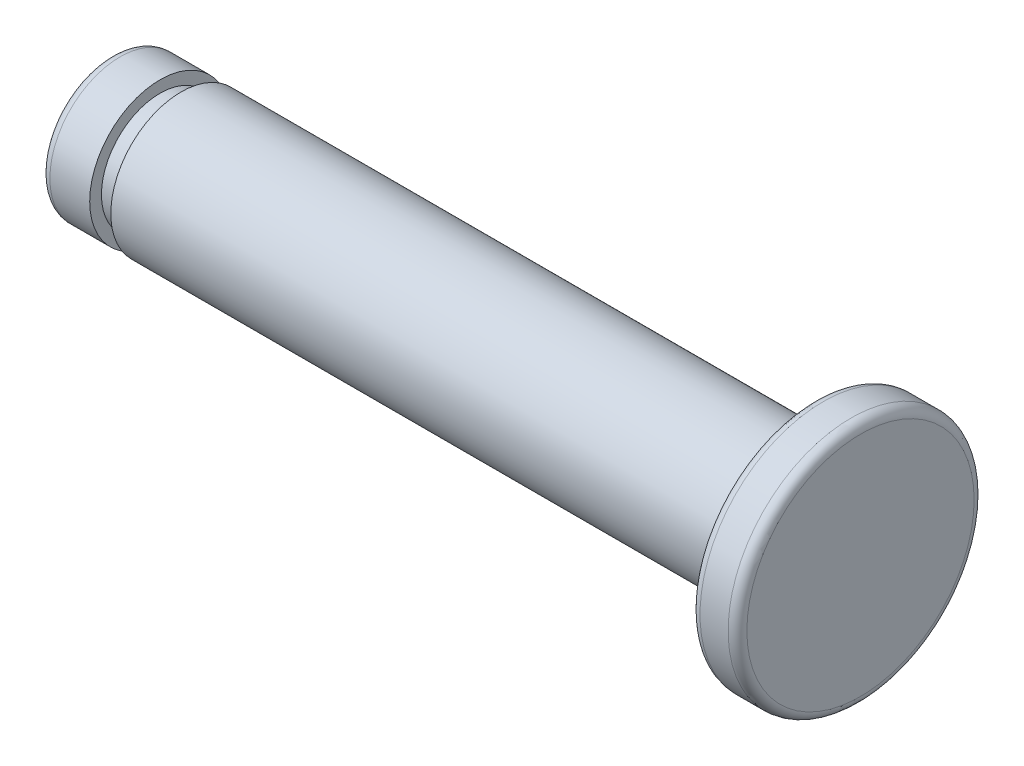
ISO-10303-21;
HEADER;
FILE_DESCRIPTION(('STEP AP214'),'2;1');
FILE_NAME('part.step','',(''),(''),'','','');
FILE_SCHEMA(('AUTOMOTIVE_DESIGN { 1 0 10303 214 1 1 1 1 }'));
ENDSEC;
DATA;
#1=APPLICATION_CONTEXT('core data for automotive mechanical design processes');
#2=APPLICATION_PROTOCOL_DEFINITION('international standard','automotive_design',2000,#1);
#3=PRODUCT_CONTEXT('',#1,'mechanical');
#4=PRODUCT('Part','Part','',(#3));
#5=PRODUCT_RELATED_PRODUCT_CATEGORY('part','',(#4));
#6=PRODUCT_DEFINITION_FORMATION('','',#4);
#7=PRODUCT_DEFINITION_CONTEXT('part definition',#1,'design');
#8=PRODUCT_DEFINITION('design','',#6,#7);
#9=PRODUCT_DEFINITION_SHAPE('','',#8);
#10=(LENGTH_UNIT() NAMED_UNIT(*) SI_UNIT(.MILLI.,.METRE.));
#11=(NAMED_UNIT(*) PLANE_ANGLE_UNIT() SI_UNIT($,.RADIAN.));
#12=(NAMED_UNIT(*) SI_UNIT($,.STERADIAN.) SOLID_ANGLE_UNIT());
#13=UNCERTAINTY_MEASURE_WITH_UNIT(LENGTH_MEASURE(1.E-05),#10,'distance_accuracy_value','');
#14=(GEOMETRIC_REPRESENTATION_CONTEXT(3) GLOBAL_UNCERTAINTY_ASSIGNED_CONTEXT((#13)) GLOBAL_UNIT_ASSIGNED_CONTEXT((#10,
#11,#12)) REPRESENTATION_CONTEXT('',''));
#15=CARTESIAN_POINT('',(0.,0.,0.));
#16=DIRECTION('',(0.,0.,1.));
#17=DIRECTION('',(1.,0.,0.));
#18=AXIS2_PLACEMENT_3D('',#15,#16,#17);
#19=CARTESIAN_POINT('',(2.,0.,0.));
#20=DIRECTION('',(-1.,0.,0.));
#21=DIRECTION('',(0.,0.,1.));
#22=AXIS2_PLACEMENT_3D('',#19,#20,#21);
#23=CYLINDRICAL_SURFACE('',#22,5.25);
#24=CARTESIAN_POINT('',(0.4,0.,0.));
#25=DIRECTION('',(1.,0.,0.));
#26=DIRECTION('',(0.,0.,-1.));
#27=AXIS2_PLACEMENT_3D('',#24,#25,#26);
#28=CIRCLE('',#27,5.25);
#29=CARTESIAN_POINT('',(0.4,0.,-5.25));
#30=VERTEX_POINT('',#29);
#31=EDGE_CURVE('E57',#30,#30,#28,.T.);
#32=ORIENTED_EDGE('',*,*,#31,.T.);
#33=EDGE_LOOP('',(#32));
#34=FACE_BOUND('',#33,.T.);
#35=CARTESIAN_POINT('',(1.6,0.,0.));
#36=DIRECTION('',(1.,0.,0.));
#37=DIRECTION('',(0.,0.,-1.));
#38=AXIS2_PLACEMENT_3D('',#35,#36,#37);
#39=CIRCLE('',#38,5.25);
#40=CARTESIAN_POINT('',(1.6,0.,-5.25));
#41=VERTEX_POINT('',#40);
#42=EDGE_CURVE('E60',#41,#41,#39,.F.);
#43=ORIENTED_EDGE('',*,*,#42,.T.);
#44=EDGE_LOOP('',(#43));
#45=FACE_BOUND('',#44,.T.);
#46=ADVANCED_FACE('F34',(#34,#45),#23,.T.);
#47=CARTESIAN_POINT('',(2.,0.,0.));
#48=DIRECTION('',(1.,0.,0.));
#49=DIRECTION('',(0.,0.,-1.));
#50=AXIS2_PLACEMENT_3D('',#47,#48,#49);
#51=PLANE('',#50);
#52=CARTESIAN_POINT('',(2.,0.,0.));
#53=DIRECTION('',(1.,0.,0.));
#54=DIRECTION('',(0.,0.,-1.));
#55=AXIS2_PLACEMENT_3D('',#52,#53,#54);
#56=CIRCLE('',#55,4.85);
#57=CARTESIAN_POINT('',(2.,0.,-4.85));
#58=VERTEX_POINT('',#57);
#59=EDGE_CURVE('E49',#58,#58,#56,.T.);
#60=ORIENTED_EDGE('',*,*,#59,.T.);
#61=EDGE_LOOP('',(#60));
#62=FACE_BOUND('',#61,.T.);
#63=ADVANCED_FACE('F91',(#62),#51,.T.);
#64=CARTESIAN_POINT('',(0.,0.,0.));
#65=DIRECTION('',(1.,0.,0.));
#66=DIRECTION('',(0.,0.,-1.));
#67=AXIS2_PLACEMENT_3D('',#64,#65,#66);
#68=PLANE('',#67);
#69=CARTESIAN_POINT('',(0.,0.,0.));
#70=DIRECTION('',(1.,0.,0.));
#71=DIRECTION('',(0.,0.,-1.));
#72=AXIS2_PLACEMENT_3D('',#69,#70,#71);
#73=CIRCLE('',#72,4.85);
#74=CARTESIAN_POINT('',(0.,0.,-4.85));
#75=VERTEX_POINT('',#74);
#76=EDGE_CURVE('E54',#75,#75,#73,.F.);
#77=ORIENTED_EDGE('',*,*,#76,.T.);
#78=EDGE_LOOP('',(#77));
#79=FACE_BOUND('',#78,.T.);
#80=CARTESIAN_POINT('',(0.,0.,0.));
#81=DIRECTION('',(1.,0.,0.));
#82=DIRECTION('',(0.,0.,-1.));
#83=AXIS2_PLACEMENT_3D('',#80,#81,#82);
#84=CIRCLE('',#83,3.);
#85=CARTESIAN_POINT('',(0.,0.,-3.));
#86=VERTEX_POINT('',#85);
#87=EDGE_CURVE('E64',#86,#86,#84,.T.);
#88=ORIENTED_EDGE('',*,*,#87,.T.);
#89=EDGE_LOOP('',(#88));
#90=FACE_BOUND('',#89,.T.);
#91=ADVANCED_FACE('F97',(#79,#90),#68,.F.);
#92=CARTESIAN_POINT('',(-27.,0.,0.));
#93=DIRECTION('',(1.,0.,0.));
#94=DIRECTION('',(0.,0.,-1.));
#95=AXIS2_PLACEMENT_3D('',#92,#93,#94);
#96=CYLINDRICAL_SURFACE('',#95,3.);
#97=CARTESIAN_POINT('',(-27.,0.,0.));
#98=DIRECTION('',(1.,0.,0.));
#99=DIRECTION('',(0.,0.,-1.));
#100=AXIS2_PLACEMENT_3D('',#97,#98,#99);
#101=CIRCLE('',#100,3.);
#102=CARTESIAN_POINT('',(-27.,0.,-3.));
#103=VERTEX_POINT('',#102);
#104=EDGE_CURVE('E63',#103,#103,#101,.T.);
#105=ORIENTED_EDGE('',*,*,#104,.T.);
#106=EDGE_LOOP('',(#105));
#107=FACE_BOUND('',#106,.T.);
#108=ORIENTED_EDGE('',*,*,#87,.F.);
#109=EDGE_LOOP('',(#108));
#110=FACE_BOUND('',#109,.T.);
#111=ADVANCED_FACE('F127',(#107,#110),#96,.T.);
#112=CARTESIAN_POINT('',(-27.,0.,0.));
#113=DIRECTION('',(1.,0.,0.));
#114=DIRECTION('',(0.,0.,-1.));
#115=AXIS2_PLACEMENT_3D('',#112,#113,#114);
#116=PLANE('',#115);
#117=CARTESIAN_POINT('',(-27.,0.,0.));
#118=DIRECTION('',(-1.,0.,0.));
#119=DIRECTION('',(0.,0.,1.));
#120=AXIS2_PLACEMENT_3D('',#117,#118,#119);
#121=CIRCLE('',#120,2.5);
#122=CARTESIAN_POINT('',(-27.,0.,2.5));
#123=VERTEX_POINT('',#122);
#124=EDGE_CURVE('E45',#123,#123,#121,.T.);
#125=ORIENTED_EDGE('',*,*,#124,.F.);
#126=EDGE_LOOP('',(#125));
#127=FACE_BOUND('',#126,.T.);
#128=ORIENTED_EDGE('',*,*,#104,.F.);
#129=EDGE_LOOP('',(#128));
#130=FACE_BOUND('',#129,.T.);
#131=ADVANCED_FACE('F106',(#127,#130),#116,.F.);
#132=CARTESIAN_POINT('',(0.4,0.,0.));
#133=DIRECTION('',(1.,0.,0.));
#134=DIRECTION('',(0.,0.,-1.));
#135=AXIS2_PLACEMENT_3D('',#132,#133,#134);
#136=TOROIDAL_SURFACE('',#135,4.85,0.4);
#137=ORIENTED_EDGE('',*,*,#76,.F.);
#138=EDGE_LOOP('',(#137));
#139=FACE_BOUND('',#138,.T.);
#140=ORIENTED_EDGE('',*,*,#31,.F.);
#141=EDGE_LOOP('',(#140));
#142=FACE_BOUND('',#141,.T.);
#143=ADVANCED_FACE('F103',(#139,#142),#136,.T.);
#144=CARTESIAN_POINT('',(1.6,0.,0.));
#145=DIRECTION('',(1.,0.,0.));
#146=DIRECTION('',(0.,0.,-1.));
#147=AXIS2_PLACEMENT_3D('',#144,#145,#146);
#148=TOROIDAL_SURFACE('',#147,4.85,0.4);
#149=ORIENTED_EDGE('',*,*,#42,.F.);
#150=EDGE_LOOP('',(#149));
#151=FACE_BOUND('',#150,.T.);
#152=ORIENTED_EDGE('',*,*,#59,.F.);
#153=EDGE_LOOP('',(#152));
#154=FACE_BOUND('',#153,.T.);
#155=ADVANCED_FACE('F105',(#151,#154),#148,.T.);
#156=CARTESIAN_POINT('',(-27.9,0.,0.));
#157=DIRECTION('',(1.,0.,0.));
#158=DIRECTION('',(0.,0.,-1.));
#159=AXIS2_PLACEMENT_3D('',#156,#157,#158);
#160=CYLINDRICAL_SURFACE('',#159,2.5);
#161=CARTESIAN_POINT('',(-27.9,0.,0.));
#162=DIRECTION('',(-1.,0.,0.));
#163=DIRECTION('',(0.,0.,1.));
#164=AXIS2_PLACEMENT_3D('',#161,#162,#163);
#165=CIRCLE('',#164,2.5);
#166=CARTESIAN_POINT('',(-27.9,0.,2.5));
#167=VERTEX_POINT('',#166);
#168=EDGE_CURVE('E67',#167,#167,#165,.T.);
#169=ORIENTED_EDGE('',*,*,#168,.F.);
#170=EDGE_LOOP('',(#169));
#171=FACE_BOUND('',#170,.T.);
#172=ORIENTED_EDGE('',*,*,#124,.T.);
#173=EDGE_LOOP('',(#172));
#174=FACE_BOUND('',#173,.T.);
#175=ADVANCED_FACE('F109',(#171,#174),#160,.T.);
#176=CARTESIAN_POINT('',(-30.,0.,0.));
#177=DIRECTION('',(1.,0.,0.));
#178=DIRECTION('',(0.,0.,-1.));
#179=AXIS2_PLACEMENT_3D('',#176,#177,#178);
#180=CYLINDRICAL_SURFACE('',#179,3.);
#181=CARTESIAN_POINT('',(-29.6,0.,0.));
#182=DIRECTION('',(-1.,0.,0.));
#183=DIRECTION('',(0.,0.,1.));
#184=AXIS2_PLACEMENT_3D('',#181,#182,#183);
#185=CIRCLE('',#184,3.);
#186=CARTESIAN_POINT('',(-29.6,0.,3.));
#187=VERTEX_POINT('',#186);
#188=EDGE_CURVE('E10',#187,#187,#185,.F.);
#189=ORIENTED_EDGE('',*,*,#188,.T.);
#190=EDGE_LOOP('',(#189));
#191=FACE_BOUND('',#190,.T.);
#192=CARTESIAN_POINT('',(-27.9,0.,0.));
#193=DIRECTION('',(-1.,0.,0.));
#194=DIRECTION('',(0.,0.,1.));
#195=AXIS2_PLACEMENT_3D('',#192,#193,#194);
#196=CIRCLE('',#195,3.);
#197=CARTESIAN_POINT('',(-27.9,0.,3.));
#198=VERTEX_POINT('',#197);
#199=EDGE_CURVE('E72',#198,#198,#196,.T.);
#200=ORIENTED_EDGE('',*,*,#199,.T.);
#201=EDGE_LOOP('',(#200));
#202=FACE_BOUND('',#201,.T.);
#203=ADVANCED_FACE('F76',(#191,#202),#180,.T.);
#204=CARTESIAN_POINT('',(-30.,0.,0.));
#205=DIRECTION('',(-1.,0.,0.));
#206=DIRECTION('',(0.,0.,1.));
#207=AXIS2_PLACEMENT_3D('',#204,#205,#206);
#208=PLANE('',#207);
#209=CARTESIAN_POINT('',(-30.,0.,0.));
#210=DIRECTION('',(-1.,0.,0.));
#211=DIRECTION('',(0.,0.,1.));
#212=AXIS2_PLACEMENT_3D('',#209,#210,#211);
#213=CIRCLE('',#212,2.6);
#214=CARTESIAN_POINT('',(-30.,0.,2.6));
#215=VERTEX_POINT('',#214);
#216=EDGE_CURVE('E41',#215,#215,#213,.T.);
#217=ORIENTED_EDGE('',*,*,#216,.T.);
#218=EDGE_LOOP('',(#217));
#219=FACE_BOUND('',#218,.T.);
#220=ADVANCED_FACE('F80',(#219),#208,.T.);
#221=CARTESIAN_POINT('',(-27.9,0.,0.));
#222=DIRECTION('',(-1.,0.,0.));
#223=DIRECTION('',(0.,0.,1.));
#224=AXIS2_PLACEMENT_3D('',#221,#222,#223);
#225=PLANE('',#224);
#226=ORIENTED_EDGE('',*,*,#168,.T.);
#227=EDGE_LOOP('',(#226));
#228=FACE_BOUND('',#227,.T.);
#229=ORIENTED_EDGE('',*,*,#199,.F.);
#230=EDGE_LOOP('',(#229));
#231=FACE_BOUND('',#230,.T.);
#232=ADVANCED_FACE('F78',(#228,#231),#225,.F.);
#233=CARTESIAN_POINT('',(-29.6,0.,0.));
#234=DIRECTION('',(-1.,0.,0.));
#235=DIRECTION('',(0.,0.,1.));
#236=AXIS2_PLACEMENT_3D('',#233,#234,#235);
#237=TOROIDAL_SURFACE('',#236,2.6,0.4);
#238=ORIENTED_EDGE('',*,*,#188,.F.);
#239=EDGE_LOOP('',(#238));
#240=FACE_BOUND('',#239,.T.);
#241=ORIENTED_EDGE('',*,*,#216,.F.);
#242=EDGE_LOOP('',(#241));
#243=FACE_BOUND('',#242,.T.);
#244=ADVANCED_FACE('F36',(#240,#243),#237,.T.);
#245=CLOSED_SHELL('',(#46,#63,#91,#111,#131,#143,#155,#175,#203,#220,#232,#244));
#246=MANIFOLD_SOLID_BREP('B2',#245);
#247=ADVANCED_BREP_SHAPE_REPRESENTATION('',(#18,#246),#14);
#248=SHAPE_DEFINITION_REPRESENTATION(#9,#247);
ENDSEC;
END-ISO-10303-21;
